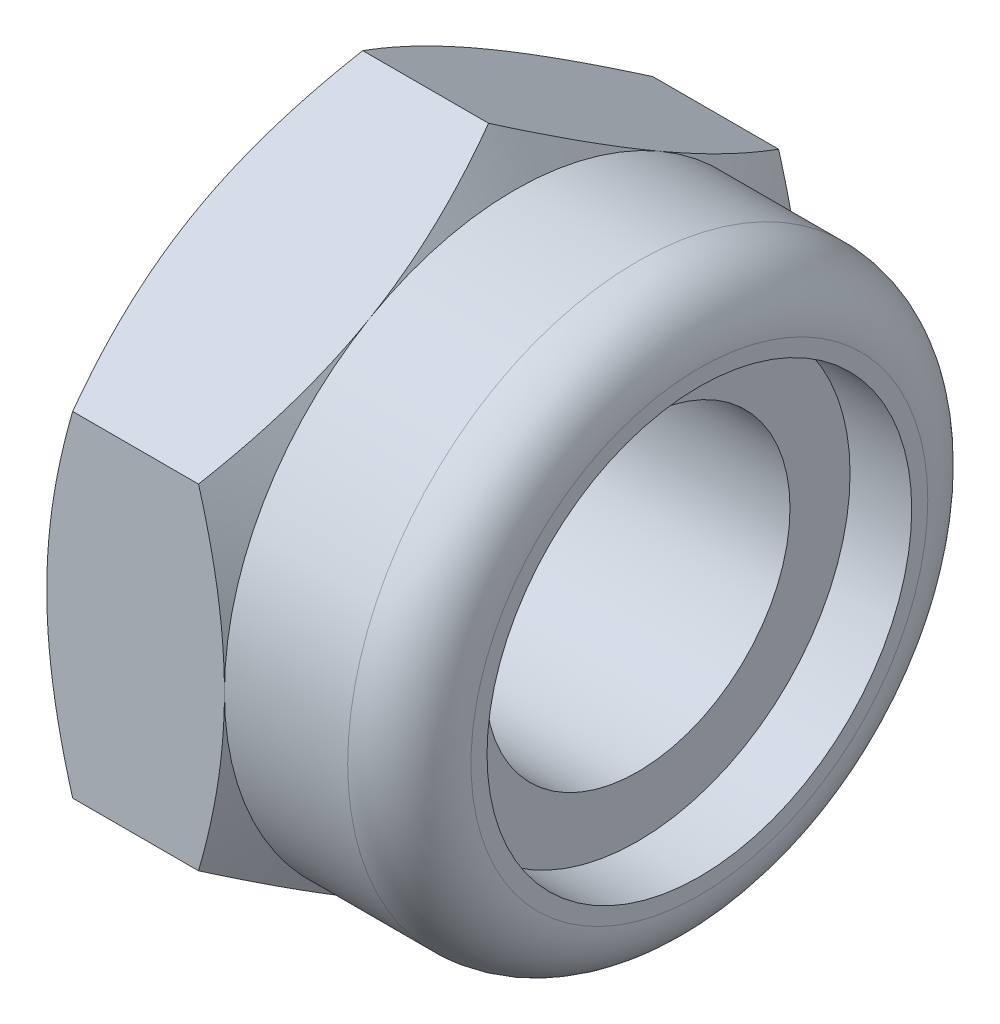
ISO-10303-21;
HEADER;
FILE_DESCRIPTION(('STEP AP214'),'2;1');
FILE_NAME('part.step','',(''),(''),'','','');
FILE_SCHEMA(('AUTOMOTIVE_DESIGN { 1 0 10303 214 1 1 1 1 }'));
ENDSEC;
DATA;
#1=APPLICATION_CONTEXT('core data for automotive mechanical design processes');
#2=APPLICATION_PROTOCOL_DEFINITION('international standard','automotive_design',2000,#1);
#3=PRODUCT_CONTEXT('',#1,'mechanical');
#4=PRODUCT('Part','Part','',(#3));
#5=PRODUCT_RELATED_PRODUCT_CATEGORY('part','',(#4));
#6=PRODUCT_DEFINITION_FORMATION('','',#4);
#7=PRODUCT_DEFINITION_CONTEXT('part definition',#1,'design');
#8=PRODUCT_DEFINITION('design','',#6,#7);
#9=PRODUCT_DEFINITION_SHAPE('','',#8);
#10=(LENGTH_UNIT() NAMED_UNIT(*) SI_UNIT(.MILLI.,.METRE.));
#11=(NAMED_UNIT(*) PLANE_ANGLE_UNIT() SI_UNIT($,.RADIAN.));
#12=(NAMED_UNIT(*) SI_UNIT($,.STERADIAN.) SOLID_ANGLE_UNIT());
#13=UNCERTAINTY_MEASURE_WITH_UNIT(LENGTH_MEASURE(1.E-05),#10,'distance_accuracy_value','');
#14=(GEOMETRIC_REPRESENTATION_CONTEXT(3) GLOBAL_UNCERTAINTY_ASSIGNED_CONTEXT((#13)) GLOBAL_UNIT_ASSIGNED_CONTEXT((#10,
#11,#12)) REPRESENTATION_CONTEXT('',''));
#15=CARTESIAN_POINT('',(0.,0.,0.));
#16=DIRECTION('',(0.,0.,1.));
#17=DIRECTION('',(1.,0.,0.));
#18=AXIS2_PLACEMENT_3D('',#15,#16,#17);
#19=CARTESIAN_POINT('',(-2.45,0.,0.));
#20=DIRECTION('',(1.,0.,0.));
#21=DIRECTION('',(0.,0.,-1.));
#22=AXIS2_PLACEMENT_3D('',#19,#20,#21);
#23=CYLINDRICAL_SURFACE('',#22,2.1);
#24=CARTESIAN_POINT('',(1.7,0.,0.));
#25=DIRECTION('',(1.,0.,0.));
#26=DIRECTION('',(0.,0.,-1.));
#27=AXIS2_PLACEMENT_3D('',#24,#25,#26);
#28=CIRCLE('',#27,2.1);
#29=CARTESIAN_POINT('',(1.7,0.,-2.1));
#30=VERTEX_POINT('',#29);
#31=EDGE_CURVE('E267',#30,#30,#28,.T.);
#32=ORIENTED_EDGE('',*,*,#31,.T.);
#33=EDGE_LOOP('',(#32));
#34=FACE_BOUND('',#33,.T.);
#35=CARTESIAN_POINT('',(-2.14451698471611,0.,0.));
#36=DIRECTION('',(-1.,0.,0.));
#37=DIRECTION('',(0.,0.,1.));
#38=AXIS2_PLACEMENT_3D('',#35,#36,#37);
#39=CIRCLE('',#38,2.1);
#40=CARTESIAN_POINT('',(-2.14451698471611,0.,2.1));
#41=VERTEX_POINT('',#40);
#42=EDGE_CURVE('E21',#41,#41,#39,.F.);
#43=ORIENTED_EDGE('',*,*,#42,.F.);
#44=EDGE_LOOP('',(#43));
#45=FACE_BOUND('',#44,.T.);
#46=ADVANCED_FACE('F16',(#34,#45),#23,.F.);
#47=CARTESIAN_POINT('',(-2.45,4.61880215351701,0.));
#48=DIRECTION('',(0.,0.866025403784438,0.500000000000001));
#49=DIRECTION('',(0.,-0.500000000000001,0.866025403784438));
#50=AXIS2_PLACEMENT_3D('',#47,#48,#49);
#51=PLANE('',#50);
#52=DIRECTION('',(1.,0.,0.));
#53=VECTOR('',#52,1.);
#54=CARTESIAN_POINT('',(-2.45,2.3094010767585,4.));
#55=LINE('',#54,#53);
#56=CARTESIAN_POINT('',(-2.09273441009184,2.30940107675851,4.));
#57=VERTEX_POINT('',#56);
#58=CARTESIAN_POINT('',(-0.357265589908164,2.3094010767585,4.));
#59=VERTEX_POINT('',#58);
#60=EDGE_CURVE('E239',#57,#59,#55,.T.);
#61=ORIENTED_EDGE('',*,*,#60,.T.);
#62=CARTESIAN_POINT('',(-0.357332259074768,2.30928560670466,4.0002));
#63=CARTESIAN_POINT('',(-0.298717873648282,2.4107717464617,3.82442084967677));
#64=CARTESIAN_POINT('',(-0.245410321462262,2.51313390883499,3.64712438367362));
#65=CARTESIAN_POINT('',(-0.152361670746403,2.71963072479811,3.28946140682429));
#66=CARTESIAN_POINT('',(-0.112653489029704,2.82376904741904,3.10908854102985));
#67=CARTESIAN_POINT('',(-0.0508422152802784,3.03075510011795,2.75057818129721));
#68=CARTESIAN_POINT('',(-0.0283277315228878,3.13357098372492,2.57249584706486));
#69=CARTESIAN_POINT('',(-0.00145062314658073,3.33968651028528,2.21549328283349));
#70=CARTESIAN_POINT('',(0.00293425857305766,3.44298540411434,2.0365743503559));
#71=CARTESIAN_POINT('',(-0.00619007293996959,3.63600352522932,1.70225715780327));
#72=CARTESIAN_POINT('',(-0.0174589539879936,3.72575165335065,1.54680884001293));
#73=CARTESIAN_POINT('',(-0.0531739907981929,3.90466320392054,1.23692494436494));
#74=CARTESIAN_POINT('',(-0.0776323457115331,3.99382600759479,1.08249043825587));
#75=CARTESIAN_POINT('',(-0.13877606491929,4.17310641015197,0.771967672225421));
#76=CARTESIAN_POINT('',(-0.175720603654864,4.26320131938131,0.615918711936897));
#77=CARTESIAN_POINT('',(-0.259570072548029,4.44204742827551,0.30614816459616));
#78=CARTESIAN_POINT('',(-0.306455302212742,4.53080091904966,0.15242260922622));
#79=CARTESIAN_POINT('',(-0.357332259074769,4.61891762357085,-0.000200000000000829));
#80=B_SPLINE_CURVE_WITH_KNOTS('',3,(#62,#63,#64,#65,#66,#67,#68,#69,#70,#71,#72,#73,#74,#75,#76,
#77,#78,#79),.UNSPECIFIED.,.F.,.F.,(4,2,2,2,2,2,2,2,4),(0.,0.634047835695967,1.26961969224544,
1.88946157213122,2.50854226669297,3.04757825393386,3.58711366126904,4.13861653143764,
4.68903648037743),.UNSPECIFIED.);
#81=CARTESIAN_POINT('',(0.,3.46410161513775,2.));
#82=VERTEX_POINT('',#81);
#83=EDGE_CURVE('E43',#59,#82,#80,.T.);
#84=ORIENTED_EDGE('',*,*,#83,.T.);
#85=CARTESIAN_POINT('',(-0.357265589908165,4.61880215351701,0.));
#86=VERTEX_POINT('',#85);
#87=EDGE_CURVE('E122',#82,#86,#80,.T.);
#88=ORIENTED_EDGE('',*,*,#87,.T.);
#89=DIRECTION('',(1.,0.,0.));
#90=VECTOR('',#89,1.);
#91=CARTESIAN_POINT('',(-2.45,4.61880215351701,0.));
#92=LINE('',#91,#90);
#93=CARTESIAN_POINT('',(-2.09273441009184,4.61880215351701,0.));
#94=VERTEX_POINT('',#93);
#95=EDGE_CURVE('E119',#94,#86,#92,.T.);
#96=ORIENTED_EDGE('',*,*,#95,.F.);
#97=CARTESIAN_POINT('',(-2.09266774092523,2.30928560670466,4.0002));
#98=CARTESIAN_POINT('',(-2.15128212635172,2.4107717464617,3.82442084967677));
#99=CARTESIAN_POINT('',(-2.20458967853774,2.51313390883499,3.64712438367362));
#100=CARTESIAN_POINT('',(-2.2976383292536,2.71963072479811,3.28946140682429));
#101=CARTESIAN_POINT('',(-2.3373465109703,2.82376904741904,3.10908854102985));
#102=CARTESIAN_POINT('',(-2.39915778471972,3.03075510011795,2.75057818129721));
#103=CARTESIAN_POINT('',(-2.42167226847711,3.13357098372492,2.57249584706486));
#104=CARTESIAN_POINT('',(-2.44854937685342,3.33968651028528,2.21549328283349));
#105=CARTESIAN_POINT('',(-2.45293425857306,3.44298540411434,2.0365743503559));
#106=CARTESIAN_POINT('',(-2.44380992706003,3.63600352522932,1.70225715780327));
#107=CARTESIAN_POINT('',(-2.43254104601201,3.72575165335065,1.54680884001293));
#108=CARTESIAN_POINT('',(-2.39682600920181,3.90466320392054,1.23692494436494));
#109=CARTESIAN_POINT('',(-2.37236765428847,3.99382600759479,1.08249043825587));
#110=CARTESIAN_POINT('',(-2.31122393508071,4.17310641015197,0.771967672225421));
#111=CARTESIAN_POINT('',(-2.27427939634514,4.26320131938131,0.615918711936897));
#112=CARTESIAN_POINT('',(-2.19042992745197,4.44204742827551,0.30614816459616));
#113=CARTESIAN_POINT('',(-2.14354469778726,4.53080091904966,0.15242260922622));
#114=CARTESIAN_POINT('',(-2.09266774092523,4.61891762357085,-0.000200000000000877));
#115=B_SPLINE_CURVE_WITH_KNOTS('',3,(#97,#98,#99,#100,#101,#102,#103,#104,#105,#106,#107,#108,
#109,#110,#111,#112,#113,#114),.UNSPECIFIED.,.F.,.F.,(4,2,2,2,2,2,2,2,4),(0.,0.634047835695968,
1.26961969224544,1.88946157213122,2.50854226669297,3.04757825393386,3.58711366126904,
4.13861653143764,4.68903648037743),.UNSPECIFIED.);
#116=CARTESIAN_POINT('',(-2.45,3.46410161513775,2.));
#117=VERTEX_POINT('',#116);
#118=EDGE_CURVE('E242',#117,#94,#115,.T.);
#119=ORIENTED_EDGE('',*,*,#118,.F.);
#120=EDGE_CURVE('E220',#57,#117,#115,.T.);
#121=ORIENTED_EDGE('',*,*,#120,.F.);
#122=EDGE_LOOP('',(#61,#84,#88,#96,#119,#121));
#123=FACE_BOUND('',#122,.T.);
#124=ADVANCED_FACE('F18',(#123),#51,.T.);
#125=CARTESIAN_POINT('',(-2.45,2.3094010767585,-4.));
#126=DIRECTION('',(0.,0.866025403784438,-0.500000000000001));
#127=DIRECTION('',(0.,0.500000000000001,0.866025403784438));
#128=AXIS2_PLACEMENT_3D('',#125,#126,#127);
#129=PLANE('',#128);
#130=ORIENTED_EDGE('',*,*,#95,.T.);
#131=CARTESIAN_POINT('',(-0.357332259074769,4.61891762357085,0.000199999999999557));
#132=CARTESIAN_POINT('',(-0.298717873648285,4.51743148381381,-0.175579150323228));
#133=CARTESIAN_POINT('',(-0.245410321462264,4.41506932144052,-0.352875616326381));
#134=CARTESIAN_POINT('',(-0.152361670746404,4.20857250547739,-0.710538593175707));
#135=CARTESIAN_POINT('',(-0.112653489029704,4.10443418285647,-0.890911458970152));
#136=CARTESIAN_POINT('',(-0.0508422152802784,3.89744813015756,-1.24942181870279));
#137=CARTESIAN_POINT('',(-0.0283277315228881,3.79463224655059,-1.42750415293514));
#138=CARTESIAN_POINT('',(-0.00145062314658083,3.58851671999023,-1.78450671716651));
#139=CARTESIAN_POINT('',(0.00293425857305792,3.48521782616117,-1.9634256496441));
#140=CARTESIAN_POINT('',(-0.00619007293996913,3.29219970504619,-2.29774284219673));
#141=CARTESIAN_POINT('',(-0.0174589539879932,3.20245157692486,-2.45319115998707));
#142=CARTESIAN_POINT('',(-0.0531739907981922,3.02354002635496,-2.76307505563506));
#143=CARTESIAN_POINT('',(-0.0776323457115321,2.93437722268072,-2.91750956174413));
#144=CARTESIAN_POINT('',(-0.138776064919289,2.75509682012354,-3.22803232777458));
#145=CARTESIAN_POINT('',(-0.175720603654863,2.6650019108942,-3.3840812880631));
#146=CARTESIAN_POINT('',(-0.259570072548027,2.486155802,-3.69385183540384));
#147=CARTESIAN_POINT('',(-0.30645530221274,2.39740231122584,-3.84757739077378));
#148=CARTESIAN_POINT('',(-0.357332259074767,2.30928560670466,-4.0002));
#149=B_SPLINE_CURVE_WITH_KNOTS('',3,(#131,#132,#133,#134,#135,#136,#137,#138,#139,#140,#141,
#142,#143,#144,#145,#146,#147,#148),.UNSPECIFIED.,.F.,.F.,(4,2,2,2,2,2,2,2,4),(0.,
0.634047835695968,1.26961969224544,1.88946157213122,2.50854226669297,3.04757825393386,
3.58711366126904,4.13861653143764,4.68903648037743),.UNSPECIFIED.);
#150=CARTESIAN_POINT('',(0.,3.46410161513775,-2.));
#151=VERTEX_POINT('',#150);
#152=EDGE_CURVE('E111',#86,#151,#149,.T.);
#153=ORIENTED_EDGE('',*,*,#152,.T.);
#154=CARTESIAN_POINT('',(-0.357265589908165,2.30940107675851,-4.));
#155=VERTEX_POINT('',#154);
#156=EDGE_CURVE('E115',#151,#155,#149,.T.);
#157=ORIENTED_EDGE('',*,*,#156,.T.);
#158=DIRECTION('',(1.,0.,0.));
#159=VECTOR('',#158,1.);
#160=CARTESIAN_POINT('',(-2.45,2.3094010767585,-4.));
#161=LINE('',#160,#159);
#162=CARTESIAN_POINT('',(-2.09273441009184,2.30940107675851,-4.));
#163=VERTEX_POINT('',#162);
#164=EDGE_CURVE('E228',#163,#155,#161,.T.);
#165=ORIENTED_EDGE('',*,*,#164,.F.);
#166=CARTESIAN_POINT('',(-2.09266774092523,4.61891762357085,0.000199999999999509));
#167=CARTESIAN_POINT('',(-2.15128212635172,4.51743148381381,-0.175579150323228));
#168=CARTESIAN_POINT('',(-2.20458967853774,4.41506932144052,-0.352875616326381));
#169=CARTESIAN_POINT('',(-2.2976383292536,4.20857250547739,-0.710538593175707));
#170=CARTESIAN_POINT('',(-2.3373465109703,4.10443418285647,-0.890911458970152));
#171=CARTESIAN_POINT('',(-2.39915778471972,3.89744813015756,-1.24942181870279));
#172=CARTESIAN_POINT('',(-2.42167226847711,3.79463224655059,-1.42750415293514));
#173=CARTESIAN_POINT('',(-2.44854937685342,3.58851671999023,-1.78450671716651));
#174=CARTESIAN_POINT('',(-2.45293425857306,3.48521782616117,-1.9634256496441));
#175=CARTESIAN_POINT('',(-2.44380992706003,3.29219970504619,-2.29774284219673));
#176=CARTESIAN_POINT('',(-2.43254104601201,3.20245157692486,-2.45319115998707));
#177=CARTESIAN_POINT('',(-2.39682600920181,3.02354002635496,-2.76307505563506));
#178=CARTESIAN_POINT('',(-2.37236765428847,2.93437722268072,-2.91750956174413));
#179=CARTESIAN_POINT('',(-2.31122393508071,2.75509682012354,-3.22803232777458));
#180=CARTESIAN_POINT('',(-2.27427939634514,2.6650019108942,-3.3840812880631));
#181=CARTESIAN_POINT('',(-2.19042992745197,2.486155802,-3.69385183540384));
#182=CARTESIAN_POINT('',(-2.14354469778726,2.39740231122584,-3.84757739077378));
#183=CARTESIAN_POINT('',(-2.09266774092523,2.30928560670466,-4.0002));
#184=B_SPLINE_CURVE_WITH_KNOTS('',3,(#166,#167,#168,#169,#170,#171,#172,#173,#174,#175,#176,
#177,#178,#179,#180,#181,#182,#183),.UNSPECIFIED.,.F.,.F.,(4,2,2,2,2,2,2,2,4),(0.,
0.634047835695967,1.26961969224544,1.88946157213122,2.50854226669297,3.04757825393386,
3.58711366126904,4.13861653143764,4.68903648037743),.UNSPECIFIED.);
#185=CARTESIAN_POINT('',(-2.45,3.46410161513775,-2.));
#186=VERTEX_POINT('',#185);
#187=EDGE_CURVE('E211',#186,#163,#184,.T.);
#188=ORIENTED_EDGE('',*,*,#187,.F.);
#189=EDGE_CURVE('E218',#94,#186,#184,.T.);
#190=ORIENTED_EDGE('',*,*,#189,.F.);
#191=EDGE_LOOP('',(#130,#153,#157,#165,#188,#190));
#192=FACE_BOUND('',#191,.T.);
#193=ADVANCED_FACE('F113',(#192),#129,.T.);
#194=CARTESIAN_POINT('',(-2.45,2.3094010767585,-4.));
#195=DIRECTION('',(0.,0.,1.));
#196=DIRECTION('',(1.,0.,0.));
#197=AXIS2_PLACEMENT_3D('',#194,#195,#196);
#198=PLANE('',#197);
#199=CARTESIAN_POINT('',(-1.91410682124064,-6.12487198995892,-4.));
#200=CARTESIAN_POINT('',(-1.8292362707669,-5.94924937038676,-4.));
#201=CARTESIAN_POINT('',(-1.7452094038074,-5.77321152095286,-4.));
#202=CARTESIAN_POINT('',(-1.57932514679716,-5.42008084777955,-4.));
#203=CARTESIAN_POINT('',(-1.49746813236723,-5.24298784779928,-4.));
#204=CARTESIAN_POINT('',(-1.33597446305856,-4.88656571686334,-4.));
#205=CARTESIAN_POINT('',(-1.25635319506304,-4.70722958889362,-4.));
#206=CARTESIAN_POINT('',(-1.1005305854203,-4.34708334747263,-4.));
#207=CARTESIAN_POINT('',(-1.02432906550802,-4.16627331143538,-4.));
#208=CARTESIAN_POINT('',(-0.875350650394363,-3.80064706744978,-4.));
#209=CARTESIAN_POINT('',(-0.802627284215846,-3.6158089282277,-4.));
#210=CARTESIAN_POINT('',(-0.66287623095942,-3.24395246794969,-4.));
#211=CARTESIAN_POINT('',(-0.595849177566504,-3.05693390695801,-4.));
#212=CARTESIAN_POINT('',(-0.469291748430882,-2.68080318253771,-4.));
#213=CARTESIAN_POINT('',(-0.409745434783837,-2.49169643712849,-4.));
#214=CARTESIAN_POINT('',(-0.300083356544506,-2.11079454635851,-4.));
#215=CARTESIAN_POINT('',(-0.249964609676752,-1.91900027185749,-4.));
#216=CARTESIAN_POINT('',(-0.161590794954042,-1.532592326982,-4.));
#217=CARTESIAN_POINT('',(-0.12333888595654,-1.3379779203165,-4.));
#218=CARTESIAN_POINT('',(-0.0612742359223428,-0.946402725872554,-4.));
#219=CARTESIAN_POINT('',(-0.0374615076516981,-0.749441936019774,-4.));
#220=CARTESIAN_POINT('',(-0.0063818131494355,-0.355451989627943,-4.));
#221=CARTESIAN_POINT('',(0.000989900761041896,-0.158431311094012,-4.));
#222=CARTESIAN_POINT('',(-0.00120406637479512,0.235472085607469,-4.));
#223=CARTESIAN_POINT('',(-0.01076535081535,0.432354826312205,-4.));
#224=CARTESIAN_POINT('',(-0.0408787346135904,0.768560635225516,-4.));
#225=CARTESIAN_POINT('',(-0.0575092960439098,0.908254618381819,-4.));
#226=CARTESIAN_POINT('',(-0.0982134103466918,1.18656349063497,-4.));
#227=CARTESIAN_POINT('',(-0.122288137058446,1.32517820601013,-4.));
#228=CARTESIAN_POINT('',(-0.20441507095023,1.73929045452969,-4.));
#229=CARTESIAN_POINT('',(-0.272348886425153,2.01284690528722,-4.));
#230=CARTESIAN_POINT('',(-0.389516359317204,2.42218253014524,-4.));
#231=CARTESIAN_POINT('',(-0.431713941811637,2.56009536361539,-4.));
#232=CARTESIAN_POINT('',(-0.520284580227763,2.83448159101404,-4.));
#233=CARTESIAN_POINT('',(-0.566654756186913,2.97095590623557,-4.));
#234=CARTESIAN_POINT('',(-0.662605699180287,3.24189440516341,-4.));
#235=CARTESIAN_POINT('',(-0.712166925753501,3.37636557946838,-4.));
#236=CARTESIAN_POINT('',(-0.814198353790703,3.64426461152914,-4.));
#237=CARTESIAN_POINT('',(-0.866669730963371,3.77769202239387,-4.));
#238=CARTESIAN_POINT('',(-0.920309006541794,3.91063698986684,-4.));
#239=B_SPLINE_CURVE_WITH_KNOTS('',3,(#199,#200,#201,#202,#203,#204,#205,#206,#207,#208,#209,
#210,#211,#212,#213,#214,#215,#216,#217,#218,#219,#220,#221,#222,#223,#224,#225,#226,#227,#228,
#229,#230,#231,#232,#233,#234,#235,#236,#237,#238),.UNSPECIFIED.,.F.,.F.,(4,2,2,2,2,2,2,2,2,2,2,
2,2,2,2,2,2,2,2,4),(0.,0.585171792532271,1.17044423059927,1.7590659464599,2.34765694284827,
2.94347400997483,3.53935727210689,4.13394864697601,4.72835161391471,5.32291267067845,
5.91747425310813,6.50823685854037,7.09884609659886,7.52068140825521,7.9425832713084,
8.7870149135983,9.21965281897689,9.65199437116297,10.0819024146297,10.5119854255247),.UNSPECIFIED.);
#240=CARTESIAN_POINT('',(-0.357265589908165,-2.30940107675851,-4.));
#241=VERTEX_POINT('',#240);
#242=CARTESIAN_POINT('',(0.,0.,-4.));
#243=VERTEX_POINT('',#242);
#244=EDGE_CURVE('E184',#241,#243,#239,.T.);
#245=ORIENTED_EDGE('',*,*,#244,.F.);
#246=DIRECTION('',(1.,0.,0.));
#247=VECTOR('',#246,1.);
#248=CARTESIAN_POINT('',(-2.45,-2.30940107675851,-4.));
#249=LINE('',#248,#247);
#250=CARTESIAN_POINT('',(-2.09273441009184,-2.30940107675851,-4.));
#251=VERTEX_POINT('',#250);
#252=EDGE_CURVE('E230',#251,#241,#249,.T.);
#253=ORIENTED_EDGE('',*,*,#252,.F.);
#254=CARTESIAN_POINT('',(-0.535893178759358,-6.12487198995892,-4.));
#255=CARTESIAN_POINT('',(-0.6207637292331,-5.94924937038676,-4.));
#256=CARTESIAN_POINT('',(-0.704790596192601,-5.77321152095286,-4.));
#257=CARTESIAN_POINT('',(-0.870674853202836,-5.42008084777954,-4.));
#258=CARTESIAN_POINT('',(-0.952531867632768,-5.24298784779927,-4.));
#259=CARTESIAN_POINT('',(-1.11402553694144,-4.88656571686334,-4.));
#260=CARTESIAN_POINT('',(-1.19364680493696,-4.70722958889362,-4.));
#261=CARTESIAN_POINT('',(-1.3494694145797,-4.34708334747263,-4.));
#262=CARTESIAN_POINT('',(-1.42567093449198,-4.16627331143537,-4.));
#263=CARTESIAN_POINT('',(-1.57464934960564,-3.80064706744977,-4.));
#264=CARTESIAN_POINT('',(-1.64737271578416,-3.6158089282277,-4.));
#265=CARTESIAN_POINT('',(-1.78712376904058,-3.24395246794968,-4.));
#266=CARTESIAN_POINT('',(-1.8541508224335,-3.05693390695801,-4.));
#267=CARTESIAN_POINT('',(-1.98070825156912,-2.6808031825377,-4.));
#268=CARTESIAN_POINT('',(-2.04025456521616,-2.49169643712848,-4.));
#269=CARTESIAN_POINT('',(-2.14991664345549,-2.11079454635851,-4.));
#270=CARTESIAN_POINT('',(-2.20003539032325,-1.91900027185749,-4.));
#271=CARTESIAN_POINT('',(-2.28840920504596,-1.532592326982,-4.));
#272=CARTESIAN_POINT('',(-2.32666111404346,-1.3379779203165,-4.));
#273=CARTESIAN_POINT('',(-2.38872576407766,-0.946402725872555,-4.));
#274=CARTESIAN_POINT('',(-2.4125384923483,-0.749441936019774,-4.));
#275=CARTESIAN_POINT('',(-2.44361818685056,-0.355451989627943,-4.));
#276=CARTESIAN_POINT('',(-2.45098990076104,-0.158431311094012,-4.));
#277=CARTESIAN_POINT('',(-2.44879593362521,0.235472085607468,-4.));
#278=CARTESIAN_POINT('',(-2.43923464918465,0.432354826312205,-4.));
#279=CARTESIAN_POINT('',(-2.40912126538641,0.768560635225517,-4.));
#280=CARTESIAN_POINT('',(-2.39249070395609,0.908254618381819,-4.));
#281=CARTESIAN_POINT('',(-2.35178658965331,1.18656349063497,-4.));
#282=CARTESIAN_POINT('',(-2.32771186294155,1.32517820601013,-4.));
#283=CARTESIAN_POINT('',(-2.24558492904977,1.73929045452969,-4.));
#284=CARTESIAN_POINT('',(-2.17765111357485,2.01284690528722,-4.));
#285=CARTESIAN_POINT('',(-2.0604836406828,2.42218253014524,-4.));
#286=CARTESIAN_POINT('',(-2.01828605818836,2.56009536361539,-4.));
#287=CARTESIAN_POINT('',(-1.92971541977224,2.83448159101404,-4.));
#288=CARTESIAN_POINT('',(-1.88334524381309,2.97095590623558,-4.));
#289=CARTESIAN_POINT('',(-1.78739430081971,3.24189440516341,-4.));
#290=CARTESIAN_POINT('',(-1.7378330742465,3.37636557946838,-4.));
#291=CARTESIAN_POINT('',(-1.6358016462093,3.64426461152914,-4.));
#292=CARTESIAN_POINT('',(-1.58333026903663,3.77769202239387,-4.));
#293=CARTESIAN_POINT('',(-1.52969099345821,3.91063698986684,-4.));
#294=B_SPLINE_CURVE_WITH_KNOTS('',3,(#254,#255,#256,#257,#258,#259,#260,#261,#262,#263,#264,
#265,#266,#267,#268,#269,#270,#271,#272,#273,#274,#275,#276,#277,#278,#279,#280,#281,#282,#283,
#284,#285,#286,#287,#288,#289,#290,#291,#292,#293),.UNSPECIFIED.,.F.,.F.,(4,2,2,2,2,2,2,2,2,2,2,
2,2,2,2,2,2,2,2,4),(0.,0.585171792532273,1.17044423059927,1.7590659464599,2.34765694284827,
2.94347400997484,3.53935727210689,4.13394864697601,4.72835161391471,5.32291267067845,
5.91747425310813,6.50823685854037,7.09884609659886,7.52068140825522,7.9425832713084,
8.7870149135983,9.2196528189769,9.65199437116298,10.0819024146297,10.5119854255247),.UNSPECIFIED.);
#295=CARTESIAN_POINT('',(-2.45,0.,-4.));
#296=VERTEX_POINT('',#295);
#297=EDGE_CURVE('E377',#251,#296,#294,.T.);
#298=ORIENTED_EDGE('',*,*,#297,.T.);
#299=EDGE_CURVE('E219',#296,#163,#294,.T.);
#300=ORIENTED_EDGE('',*,*,#299,.T.);
#301=ORIENTED_EDGE('',*,*,#164,.T.);
#302=EDGE_CURVE('E129',#243,#155,#239,.T.);
#303=ORIENTED_EDGE('',*,*,#302,.F.);
#304=EDGE_LOOP('',(#245,#253,#298,#300,#301,#303));
#305=FACE_BOUND('',#304,.T.);
#306=ADVANCED_FACE('F206',(#305),#198,.F.);
#307=CARTESIAN_POINT('',(-2.45,-4.61880215351701,0.));
#308=DIRECTION('',(0.,-0.866025403784438,-0.500000000000001));
#309=DIRECTION('',(0.,0.500000000000001,-0.866025403784438));
#310=AXIS2_PLACEMENT_3D('',#307,#308,#309);
#311=PLANE('',#310);
#312=ORIENTED_EDGE('',*,*,#252,.T.);
#313=CARTESIAN_POINT('',(-0.357332259074769,-2.30928560670467,-4.0002));
#314=CARTESIAN_POINT('',(-0.298717873648284,-2.41077174646171,-3.82442084967677));
#315=CARTESIAN_POINT('',(-0.245410321462264,-2.513133908835,-3.64712438367362));
#316=CARTESIAN_POINT('',(-0.152361670746405,-2.71963072479812,-3.28946140682429));
#317=CARTESIAN_POINT('',(-0.112653489029705,-2.82376904741905,-3.10908854102985));
#318=CARTESIAN_POINT('',(-0.0508422152802804,-3.03075510011796,-2.75057818129721));
#319=CARTESIAN_POINT('',(-0.0283277315228903,-3.13357098372492,-2.57249584706486));
#320=CARTESIAN_POINT('',(-0.00145062314658341,-3.33968651028529,-2.21549328283349));
#321=CARTESIAN_POINT('',(0.00293425857305511,-3.44298540411435,-2.0365743503559));
#322=CARTESIAN_POINT('',(-0.00619007293997252,-3.63600352522933,-1.70225715780326));
#323=CARTESIAN_POINT('',(-0.0174589539879969,-3.72575165335065,-1.54680884001293));
#324=CARTESIAN_POINT('',(-0.0531739907981964,-3.90466320392055,-1.23692494436494));
#325=CARTESIAN_POINT('',(-0.0776323457115366,-3.99382600759479,-1.08249043825587));
#326=CARTESIAN_POINT('',(-0.138776064919293,-4.17310641015198,-0.771967672225421));
#327=CARTESIAN_POINT('',(-0.175720603654868,-4.26320131938132,-0.615918711936897));
#328=CARTESIAN_POINT('',(-0.259570072548032,-4.44204742827551,-0.30614816459616));
#329=CARTESIAN_POINT('',(-0.306455302212745,-4.53080091904967,-0.152422609226221));
#330=CARTESIAN_POINT('',(-0.357332259074773,-4.61891762357085,0.000200000000000193));
#331=B_SPLINE_CURVE_WITH_KNOTS('',3,(#313,#314,#315,#316,#317,#318,#319,#320,#321,#322,#323,
#324,#325,#326,#327,#328,#329,#330),.UNSPECIFIED.,.F.,.F.,(4,2,2,2,2,2,2,2,4),(0.,
0.634047835695967,1.26961969224544,1.88946157213122,2.50854226669298,3.04757825393386,
3.58711366126904,4.13861653143764,4.68903648037743),.UNSPECIFIED.);
#332=CARTESIAN_POINT('',(0.,-3.46410161513775,-2.));
#333=VERTEX_POINT('',#332);
#334=EDGE_CURVE('E315',#241,#333,#331,.T.);
#335=ORIENTED_EDGE('',*,*,#334,.T.);
#336=CARTESIAN_POINT('',(-0.357265589908165,-4.61880215351701,0.));
#337=VERTEX_POINT('',#336);
#338=EDGE_CURVE('E177',#333,#337,#331,.T.);
#339=ORIENTED_EDGE('',*,*,#338,.T.);
#340=DIRECTION('',(1.,0.,0.));
#341=VECTOR('',#340,1.);
#342=CARTESIAN_POINT('',(-2.45,-4.61880215351701,0.));
#343=LINE('',#342,#341);
#344=CARTESIAN_POINT('',(-2.09273441009184,-4.61880215351701,0.));
#345=VERTEX_POINT('',#344);
#346=EDGE_CURVE('E233',#345,#337,#343,.T.);
#347=ORIENTED_EDGE('',*,*,#346,.F.);
#348=CARTESIAN_POINT('',(-2.09266774092523,-2.30928560670467,-4.0002));
#349=CARTESIAN_POINT('',(-2.15128212635172,-2.41077174646171,-3.82442084967677));
#350=CARTESIAN_POINT('',(-2.20458967853774,-2.513133908835,-3.64712438367362));
#351=CARTESIAN_POINT('',(-2.2976383292536,-2.71963072479812,-3.28946140682429));
#352=CARTESIAN_POINT('',(-2.3373465109703,-2.82376904741905,-3.10908854102985));
#353=CARTESIAN_POINT('',(-2.39915778471972,-3.03075510011796,-2.75057818129721));
#354=CARTESIAN_POINT('',(-2.42167226847711,-3.13357098372492,-2.57249584706486));
#355=CARTESIAN_POINT('',(-2.44854937685342,-3.33968651028529,-2.21549328283349));
#356=CARTESIAN_POINT('',(-2.45293425857306,-3.44298540411435,-2.0365743503559));
#357=CARTESIAN_POINT('',(-2.44380992706003,-3.63600352522933,-1.70225715780326));
#358=CARTESIAN_POINT('',(-2.432541046012,-3.72575165335065,-1.54680884001293));
#359=CARTESIAN_POINT('',(-2.3968260092018,-3.90466320392055,-1.23692494436494));
#360=CARTESIAN_POINT('',(-2.37236765428846,-3.99382600759479,-1.08249043825587));
#361=CARTESIAN_POINT('',(-2.31122393508071,-4.17310641015198,-0.771967672225421));
#362=CARTESIAN_POINT('',(-2.27427939634513,-4.26320131938132,-0.615918711936897));
#363=CARTESIAN_POINT('',(-2.19042992745197,-4.44204742827551,-0.30614816459616));
#364=CARTESIAN_POINT('',(-2.14354469778725,-4.53080091904967,-0.15242260922622));
#365=CARTESIAN_POINT('',(-2.09266774092523,-4.61891762357085,0.000200000000000137));
#366=B_SPLINE_CURVE_WITH_KNOTS('',3,(#348,#349,#350,#351,#352,#353,#354,#355,#356,#357,#358,
#359,#360,#361,#362,#363,#364,#365),.UNSPECIFIED.,.F.,.F.,(4,2,2,2,2,2,2,2,4),(0.,
0.634047835695967,1.26961969224544,1.88946157213122,2.50854226669298,3.04757825393386,
3.58711366126904,4.13861653143764,4.68903648037743),.UNSPECIFIED.);
#367=CARTESIAN_POINT('',(-2.45,-3.46410161513775,-2.));
#368=VERTEX_POINT('',#367);
#369=EDGE_CURVE('E351',#368,#345,#366,.T.);
#370=ORIENTED_EDGE('',*,*,#369,.F.);
#371=EDGE_CURVE('E376',#251,#368,#366,.T.);
#372=ORIENTED_EDGE('',*,*,#371,.F.);
#373=EDGE_LOOP('',(#312,#335,#339,#347,#370,#372));
#374=FACE_BOUND('',#373,.T.);
#375=ADVANCED_FACE('F367',(#374),#311,.T.);
#376=CARTESIAN_POINT('',(-2.45,-2.30940107675851,4.));
#377=DIRECTION('',(0.,-0.866025403784438,0.500000000000001));
#378=DIRECTION('',(0.,-0.500000000000001,-0.866025403784438));
#379=AXIS2_PLACEMENT_3D('',#376,#377,#378);
#380=PLANE('',#379);
#381=ORIENTED_EDGE('',*,*,#346,.T.);
#382=CARTESIAN_POINT('',(-0.357332259074773,-4.61891762357085,-0.00019999999999976));
#383=CARTESIAN_POINT('',(-0.298717873648288,-4.51743148381381,0.175579150323228));
#384=CARTESIAN_POINT('',(-0.245410321462267,-4.41506932144052,0.352875616326381));
#385=CARTESIAN_POINT('',(-0.152361670746407,-4.2085725054774,0.710538593175708));
#386=CARTESIAN_POINT('',(-0.112653489029707,-4.10443418285647,0.890911458970153));
#387=CARTESIAN_POINT('',(-0.0508422152802817,-3.89744813015756,1.24942181870279));
#388=CARTESIAN_POINT('',(-0.0283277315228913,-3.7946322465506,1.42750415293515));
#389=CARTESIAN_POINT('',(-0.00145062314658384,-3.58851671999023,1.78450671716651));
#390=CARTESIAN_POINT('',(0.00293425857305513,-3.48521782616117,1.9634256496441));
#391=CARTESIAN_POINT('',(-0.00619007293997194,-3.29219970504619,2.29774284219674));
#392=CARTESIAN_POINT('',(-0.0174589539879962,-3.20245157692487,2.45319115998707));
#393=CARTESIAN_POINT('',(-0.0531739907981951,-3.02354002635497,2.76307505563506));
#394=CARTESIAN_POINT('',(-0.0776323457115348,-2.93437722268073,2.91750956174413));
#395=CARTESIAN_POINT('',(-0.138776064919291,-2.75509682012354,3.22803232777458));
#396=CARTESIAN_POINT('',(-0.175720603654865,-2.6650019108942,3.3840812880631));
#397=CARTESIAN_POINT('',(-0.259570072548029,-2.48615580200001,3.69385183540384));
#398=CARTESIAN_POINT('',(-0.306455302212742,-2.39740231122585,3.84757739077378));
#399=CARTESIAN_POINT('',(-0.357332259074769,-2.30928560670467,4.0002));
#400=B_SPLINE_CURVE_WITH_KNOTS('',3,(#382,#383,#384,#385,#386,#387,#388,#389,#390,#391,#392,
#393,#394,#395,#396,#397,#398,#399),.UNSPECIFIED.,.F.,.F.,(4,2,2,2,2,2,2,2,4),(0.,
0.634047835695968,1.26961969224544,1.88946157213123,2.50854226669298,3.04757825393386,
3.58711366126904,4.13861653143764,4.68903648037743),.UNSPECIFIED.);
#401=CARTESIAN_POINT('',(0.,-3.46410161513775,2.));
#402=VERTEX_POINT('',#401);
#403=EDGE_CURVE('E308',#337,#402,#400,.T.);
#404=ORIENTED_EDGE('',*,*,#403,.T.);
#405=CARTESIAN_POINT('',(-0.357265589908165,-2.30940107675851,4.));
#406=VERTEX_POINT('',#405);
#407=EDGE_CURVE('E150',#402,#406,#400,.T.);
#408=ORIENTED_EDGE('',*,*,#407,.T.);
#409=DIRECTION('',(1.,0.,0.));
#410=VECTOR('',#409,1.);
#411=CARTESIAN_POINT('',(-2.45,-2.30940107675851,4.));
#412=LINE('',#411,#410);
#413=CARTESIAN_POINT('',(-2.09273441009184,-2.30940107675851,4.));
#414=VERTEX_POINT('',#413);
#415=EDGE_CURVE('E236',#414,#406,#412,.T.);
#416=ORIENTED_EDGE('',*,*,#415,.F.);
#417=CARTESIAN_POINT('',(-2.09266774092523,-4.61891762357085,-0.000199999999999808));
#418=CARTESIAN_POINT('',(-2.15128212635171,-4.51743148381381,0.175579150323228));
#419=CARTESIAN_POINT('',(-2.20458967853773,-4.41506932144052,0.352875616326382));
#420=CARTESIAN_POINT('',(-2.29763832925359,-4.2085725054774,0.710538593175708));
#421=CARTESIAN_POINT('',(-2.33734651097029,-4.10443418285647,0.890911458970153));
#422=CARTESIAN_POINT('',(-2.39915778471972,-3.89744813015756,1.24942181870279));
#423=CARTESIAN_POINT('',(-2.42167226847711,-3.7946322465506,1.42750415293515));
#424=CARTESIAN_POINT('',(-2.44854937685342,-3.58851671999023,1.78450671716651));
#425=CARTESIAN_POINT('',(-2.45293425857306,-3.48521782616117,1.9634256496441));
#426=CARTESIAN_POINT('',(-2.44380992706003,-3.29219970504619,2.29774284219674));
#427=CARTESIAN_POINT('',(-2.432541046012,-3.20245157692487,2.45319115998707));
#428=CARTESIAN_POINT('',(-2.39682600920181,-3.02354002635497,2.76307505563506));
#429=CARTESIAN_POINT('',(-2.37236765428847,-2.93437722268073,2.91750956174413));
#430=CARTESIAN_POINT('',(-2.31122393508071,-2.75509682012354,3.22803232777458));
#431=CARTESIAN_POINT('',(-2.27427939634513,-2.6650019108942,3.3840812880631));
#432=CARTESIAN_POINT('',(-2.19042992745197,-2.48615580200001,3.69385183540384));
#433=CARTESIAN_POINT('',(-2.14354469778726,-2.39740231122585,3.84757739077378));
#434=CARTESIAN_POINT('',(-2.09266774092523,-2.30928560670467,4.0002));
#435=B_SPLINE_CURVE_WITH_KNOTS('',3,(#417,#418,#419,#420,#421,#422,#423,#424,#425,#426,#427,
#428,#429,#430,#431,#432,#433,#434),.UNSPECIFIED.,.F.,.F.,(4,2,2,2,2,2,2,2,4),(0.,
0.634047835695968,1.26961969224544,1.88946157213123,2.50854226669298,3.04757825393386,
3.58711366126904,4.13861653143764,4.68903648037744),.UNSPECIFIED.);
#436=CARTESIAN_POINT('',(-2.45,-3.46410161513775,2.));
#437=VERTEX_POINT('',#436);
#438=EDGE_CURVE('E345',#437,#414,#435,.T.);
#439=ORIENTED_EDGE('',*,*,#438,.F.);
#440=EDGE_CURVE('E346',#345,#437,#435,.T.);
#441=ORIENTED_EDGE('',*,*,#440,.F.);
#442=EDGE_LOOP('',(#381,#404,#408,#416,#439,#441));
#443=FACE_BOUND('',#442,.T.);
#444=ADVANCED_FACE('F311',(#443),#380,.T.);
#445=CARTESIAN_POINT('',(-2.45,2.3094010767585,4.));
#446=DIRECTION('',(0.,0.,1.));
#447=DIRECTION('',(1.,0.,0.));
#448=AXIS2_PLACEMENT_3D('',#445,#446,#447);
#449=PLANE('',#448);
#450=ORIENTED_EDGE('',*,*,#415,.T.);
#451=CARTESIAN_POINT('',(-1.91410682124064,-6.12487198995892,4.));
#452=CARTESIAN_POINT('',(-1.8292362707669,-5.94924937038676,4.));
#453=CARTESIAN_POINT('',(-1.7452094038074,-5.77321152095286,4.));
#454=CARTESIAN_POINT('',(-1.57932514679716,-5.42008084777954,4.));
#455=CARTESIAN_POINT('',(-1.49746813236723,-5.24298784779928,4.));
#456=CARTESIAN_POINT('',(-1.33597446305856,-4.88656571686334,4.));
#457=CARTESIAN_POINT('',(-1.25635319506304,-4.70722958889362,4.));
#458=CARTESIAN_POINT('',(-1.1005305854203,-4.34708334747263,4.));
#459=CARTESIAN_POINT('',(-1.02432906550802,-4.16627331143537,4.));
#460=CARTESIAN_POINT('',(-0.875350650394363,-3.80064706744978,4.));
#461=CARTESIAN_POINT('',(-0.802627284215846,-3.6158089282277,4.));
#462=CARTESIAN_POINT('',(-0.66287623095942,-3.24395246794968,4.));
#463=CARTESIAN_POINT('',(-0.595849177566504,-3.05693390695801,4.));
#464=CARTESIAN_POINT('',(-0.469291748430881,-2.68080318253771,4.));
#465=CARTESIAN_POINT('',(-0.409745434783837,-2.49169643712849,4.));
#466=CARTESIAN_POINT('',(-0.300083356544506,-2.11079454635851,4.));
#467=CARTESIAN_POINT('',(-0.249964609676752,-1.91900027185749,4.));
#468=CARTESIAN_POINT('',(-0.161590794954041,-1.532592326982,4.));
#469=CARTESIAN_POINT('',(-0.123338885956539,-1.3379779203165,4.));
#470=CARTESIAN_POINT('',(-0.0612742359223427,-0.946402725872553,4.));
#471=CARTESIAN_POINT('',(-0.0374615076516984,-0.749441936019772,4.));
#472=CARTESIAN_POINT('',(-0.0063818131494359,-0.355451989627941,4.));
#473=CARTESIAN_POINT('',(0.000989900761041723,-0.15843131109401,4.));
#474=CARTESIAN_POINT('',(-0.00120406637479555,0.23547208560747,4.));
#475=CARTESIAN_POINT('',(-0.010765350815351,0.432354826312206,4.));
#476=CARTESIAN_POINT('',(-0.040878734613591,0.768560635225518,4.));
#477=CARTESIAN_POINT('',(-0.05750929604391,0.908254618381821,4.));
#478=CARTESIAN_POINT('',(-0.0982134103466921,1.18656349063497,4.));
#479=CARTESIAN_POINT('',(-0.122288137058447,1.32517820601013,4.));
#480=CARTESIAN_POINT('',(-0.204415070950232,1.73929045452969,4.));
#481=CARTESIAN_POINT('',(-0.272348886425154,2.01284690528722,4.));
#482=CARTESIAN_POINT('',(-0.389516359317204,2.42218253014524,4.));
#483=CARTESIAN_POINT('',(-0.431713941811637,2.56009536361539,4.));
#484=CARTESIAN_POINT('',(-0.520284580227764,2.83448159101404,4.));
#485=CARTESIAN_POINT('',(-0.566654756186914,2.97095590623558,4.));
#486=CARTESIAN_POINT('',(-0.662605699180289,3.24189440516341,4.));
#487=CARTESIAN_POINT('',(-0.712166925753502,3.37636557946838,4.));
#488=CARTESIAN_POINT('',(-0.814198353790704,3.64426461152914,4.));
#489=CARTESIAN_POINT('',(-0.866669730963372,3.77769202239387,4.));
#490=CARTESIAN_POINT('',(-0.920309006541795,3.91063698986685,4.));
#491=B_SPLINE_CURVE_WITH_KNOTS('',3,(#451,#452,#453,#454,#455,#456,#457,#458,#459,#460,#461,
#462,#463,#464,#465,#466,#467,#468,#469,#470,#471,#472,#473,#474,#475,#476,#477,#478,#479,#480,
#481,#482,#483,#484,#485,#486,#487,#488,#489,#490),.UNSPECIFIED.,.F.,.F.,(4,2,2,2,2,2,2,2,2,2,2,
2,2,2,2,2,2,2,2,4),(0.,0.585171792532271,1.17044423059927,1.7590659464599,2.34765694284827,
2.94347400997483,3.53935727210689,4.13394864697601,4.72835161391471,5.32291267067845,
5.91747425310813,6.50823685854037,7.09884609659886,7.52068140825522,7.9425832713084,
8.7870149135983,9.2196528189769,9.65199437116298,10.0819024146297,10.5119854255247),.UNSPECIFIED.);
#492=CARTESIAN_POINT('',(0.,0.,4.));
#493=VERTEX_POINT('',#492);
#494=EDGE_CURVE('E137',#406,#493,#491,.T.);
#495=ORIENTED_EDGE('',*,*,#494,.T.);
#496=EDGE_CURVE('E135',#493,#59,#491,.T.);
#497=ORIENTED_EDGE('',*,*,#496,.T.);
#498=ORIENTED_EDGE('',*,*,#60,.F.);
#499=CARTESIAN_POINT('',(-0.535893178759359,-6.12487198995892,4.));
#500=CARTESIAN_POINT('',(-0.620763729233101,-5.94924937038676,4.));
#501=CARTESIAN_POINT('',(-0.704790596192602,-5.77321152095286,4.));
#502=CARTESIAN_POINT('',(-0.870674853202836,-5.42008084777954,4.));
#503=CARTESIAN_POINT('',(-0.952531867632769,-5.24298784779927,4.));
#504=CARTESIAN_POINT('',(-1.11402553694144,-4.88656571686334,4.));
#505=CARTESIAN_POINT('',(-1.19364680493696,-4.70722958889362,4.));
#506=CARTESIAN_POINT('',(-1.3494694145797,-4.34708334747263,4.));
#507=CARTESIAN_POINT('',(-1.42567093449198,-4.16627331143537,4.));
#508=CARTESIAN_POINT('',(-1.57464934960564,-3.80064706744977,4.));
#509=CARTESIAN_POINT('',(-1.64737271578416,-3.6158089282277,4.));
#510=CARTESIAN_POINT('',(-1.78712376904058,-3.24395246794968,4.));
#511=CARTESIAN_POINT('',(-1.8541508224335,-3.05693390695801,4.));
#512=CARTESIAN_POINT('',(-1.98070825156912,-2.6808031825377,4.));
#513=CARTESIAN_POINT('',(-2.04025456521616,-2.49169643712848,4.));
#514=CARTESIAN_POINT('',(-2.14991664345549,-2.11079454635851,4.));
#515=CARTESIAN_POINT('',(-2.20003539032325,-1.91900027185749,4.));
#516=CARTESIAN_POINT('',(-2.28840920504596,-1.532592326982,4.));
#517=CARTESIAN_POINT('',(-2.32666111404346,-1.3379779203165,4.));
#518=CARTESIAN_POINT('',(-2.38872576407766,-0.946402725872553,4.));
#519=CARTESIAN_POINT('',(-2.4125384923483,-0.749441936019773,4.));
#520=CARTESIAN_POINT('',(-2.44361818685056,-0.355451989627942,4.));
#521=CARTESIAN_POINT('',(-2.45098990076104,-0.158431311094011,4.));
#522=CARTESIAN_POINT('',(-2.44879593362521,0.235472085607469,4.));
#523=CARTESIAN_POINT('',(-2.43923464918465,0.432354826312206,4.));
#524=CARTESIAN_POINT('',(-2.40912126538641,0.768560635225518,4.));
#525=CARTESIAN_POINT('',(-2.39249070395609,0.90825461838182,4.));
#526=CARTESIAN_POINT('',(-2.35178658965331,1.18656349063497,4.));
#527=CARTESIAN_POINT('',(-2.32771186294155,1.32517820601013,4.));
#528=CARTESIAN_POINT('',(-2.24558492904977,1.73929045452969,4.));
#529=CARTESIAN_POINT('',(-2.17765111357485,2.01284690528722,4.));
#530=CARTESIAN_POINT('',(-2.0604836406828,2.42218253014524,4.));
#531=CARTESIAN_POINT('',(-2.01828605818836,2.56009536361539,4.));
#532=CARTESIAN_POINT('',(-1.92971541977224,2.83448159101404,4.));
#533=CARTESIAN_POINT('',(-1.88334524381309,2.97095590623558,4.));
#534=CARTESIAN_POINT('',(-1.78739430081971,3.24189440516341,4.));
#535=CARTESIAN_POINT('',(-1.7378330742465,3.37636557946838,4.));
#536=CARTESIAN_POINT('',(-1.6358016462093,3.64426461152914,4.));
#537=CARTESIAN_POINT('',(-1.58333026903663,3.77769202239387,4.));
#538=CARTESIAN_POINT('',(-1.52969099345821,3.91063698986684,4.));
#539=B_SPLINE_CURVE_WITH_KNOTS('',3,(#499,#500,#501,#502,#503,#504,#505,#506,#507,#508,#509,
#510,#511,#512,#513,#514,#515,#516,#517,#518,#519,#520,#521,#522,#523,#524,#525,#526,#527,#528,
#529,#530,#531,#532,#533,#534,#535,#536,#537,#538),.UNSPECIFIED.,.F.,.F.,(4,2,2,2,2,2,2,2,2,2,2,
2,2,2,2,2,2,2,2,4),(0.,0.585171792532272,1.17044423059927,1.7590659464599,2.34765694284827,
2.94347400997484,3.53935727210689,4.13394864697601,4.72835161391471,5.32291267067845,
5.91747425310813,6.50823685854037,7.09884609659886,7.52068140825522,7.9425832713084,
8.7870149135983,9.2196528189769,9.65199437116298,10.0819024146297,10.5119854255247),.UNSPECIFIED.);
#540=CARTESIAN_POINT('',(-2.45,0.,4.));
#541=VERTEX_POINT('',#540);
#542=EDGE_CURVE('E299',#541,#57,#539,.T.);
#543=ORIENTED_EDGE('',*,*,#542,.F.);
#544=EDGE_CURVE('E349',#414,#541,#539,.T.);
#545=ORIENTED_EDGE('',*,*,#544,.F.);
#546=EDGE_LOOP('',(#450,#495,#497,#498,#543,#545));
#547=FACE_BOUND('',#546,.T.);
#548=ADVANCED_FACE('F157',(#547),#449,.T.);
#549=CARTESIAN_POINT('',(-2.45,0.,7.99999999999999));
#550=DIRECTION('',(1.,0.,0.));
#551=DIRECTION('',(0.,0.,-1.));
#552=AXIS2_PLACEMENT_3D('',#549,#550,#551);
#553=PLANE('',#552);
#554=CARTESIAN_POINT('',(-2.45,0.,0.));
#555=DIRECTION('',(1.,0.,0.));
#556=DIRECTION('',(0.,0.,-1.));
#557=AXIS2_PLACEMENT_3D('',#554,#555,#556);
#558=CIRCLE('',#557,2.5);
#559=CARTESIAN_POINT('',(-2.45,0.,-2.5));
#560=VERTEX_POINT('',#559);
#561=EDGE_CURVE('E140',#560,#560,#558,.F.);
#562=ORIENTED_EDGE('',*,*,#561,.F.);
#563=EDGE_LOOP('',(#562));
#564=FACE_BOUND('',#563,.T.);
#565=CARTESIAN_POINT('',(-2.45,0.,0.));
#566=DIRECTION('',(1.,0.,0.));
#567=DIRECTION('',(0.,0.,-1.));
#568=AXIS2_PLACEMENT_3D('',#565,#566,#567);
#569=CIRCLE('',#568,4.);
#570=EDGE_CURVE('E201',#296,#186,#569,.T.);
#571=ORIENTED_EDGE('',*,*,#570,.F.);
#572=CARTESIAN_POINT('',(-2.45,0.,0.));
#573=DIRECTION('',(1.,0.,0.));
#574=DIRECTION('',(0.,0.,-1.));
#575=AXIS2_PLACEMENT_3D('',#572,#573,#574);
#576=CIRCLE('',#575,4.);
#577=EDGE_CURVE('E243',#296,#368,#576,.F.);
#578=ORIENTED_EDGE('',*,*,#577,.T.);
#579=EDGE_CURVE('E245',#368,#437,#576,.F.);
#580=ORIENTED_EDGE('',*,*,#579,.T.);
#581=EDGE_CURVE('E338',#437,#541,#576,.F.);
#582=ORIENTED_EDGE('',*,*,#581,.T.);
#583=EDGE_CURVE('E336',#541,#117,#576,.F.);
#584=ORIENTED_EDGE('',*,*,#583,.T.);
#585=EDGE_CURVE('E227',#117,#186,#576,.F.);
#586=ORIENTED_EDGE('',*,*,#585,.T.);
#587=EDGE_LOOP('',(#571,#578,#580,#582,#584,#586));
#588=FACE_BOUND('',#587,.T.);
#589=ADVANCED_FACE('F207',(#564,#588),#553,.F.);
#590=CARTESIAN_POINT('',(-2.45,0.,0.));
#591=DIRECTION('',(1.,0.,0.));
#592=DIRECTION('',(0.,0.,-1.));
#593=AXIS2_PLACEMENT_3D('',#590,#591,#592);
#594=CONICAL_SURFACE('',#593,4.,1.0471975511966);
#595=ORIENTED_EDGE('',*,*,#187,.T.);
#596=ORIENTED_EDGE('',*,*,#299,.F.);
#597=ORIENTED_EDGE('',*,*,#570,.T.);
#598=EDGE_LOOP('',(#595,#596,#597));
#599=FACE_BOUND('',#598,.T.);
#600=ADVANCED_FACE('F329',(#599),#594,.T.);
#601=ORIENTED_EDGE('',*,*,#118,.T.);
#602=ORIENTED_EDGE('',*,*,#189,.T.);
#603=ORIENTED_EDGE('',*,*,#585,.F.);
#604=EDGE_LOOP('',(#601,#602,#603));
#605=FACE_BOUND('',#604,.T.);
#606=ADVANCED_FACE('F386',(#605),#594,.T.);
#607=ORIENTED_EDGE('',*,*,#120,.T.);
#608=ORIENTED_EDGE('',*,*,#583,.F.);
#609=ORIENTED_EDGE('',*,*,#542,.T.);
#610=EDGE_LOOP('',(#607,#608,#609));
#611=FACE_BOUND('',#610,.T.);
#612=ADVANCED_FACE('F385',(#611),#594,.T.);
#613=ORIENTED_EDGE('',*,*,#438,.T.);
#614=ORIENTED_EDGE('',*,*,#544,.T.);
#615=ORIENTED_EDGE('',*,*,#581,.F.);
#616=EDGE_LOOP('',(#613,#614,#615));
#617=FACE_BOUND('',#616,.T.);
#618=ADVANCED_FACE('F169',(#617),#594,.T.);
#619=ORIENTED_EDGE('',*,*,#369,.T.);
#620=ORIENTED_EDGE('',*,*,#440,.T.);
#621=ORIENTED_EDGE('',*,*,#579,.F.);
#622=EDGE_LOOP('',(#619,#620,#621));
#623=FACE_BOUND('',#622,.T.);
#624=ADVANCED_FACE('F383',(#623),#594,.T.);
#625=ORIENTED_EDGE('',*,*,#371,.T.);
#626=ORIENTED_EDGE('',*,*,#577,.F.);
#627=ORIENTED_EDGE('',*,*,#297,.F.);
#628=EDGE_LOOP('',(#625,#626,#627));
#629=FACE_BOUND('',#628,.T.);
#630=ADVANCED_FACE('F391',(#629),#594,.T.);
#631=CARTESIAN_POINT('',(0.,0.,0.));
#632=DIRECTION('',(-1.,0.,0.));
#633=DIRECTION('',(0.,0.,1.));
#634=AXIS2_PLACEMENT_3D('',#631,#632,#633);
#635=CONICAL_SURFACE('',#634,4.,1.0471975511966);
#636=ORIENTED_EDGE('',*,*,#244,.T.);
#637=CARTESIAN_POINT('',(0.,0.,0.));
#638=DIRECTION('',(1.,0.,0.));
#639=DIRECTION('',(0.,0.,-1.));
#640=AXIS2_PLACEMENT_3D('',#637,#638,#639);
#641=CIRCLE('',#640,4.);
#642=EDGE_CURVE('E28',#333,#243,#641,.T.);
#643=ORIENTED_EDGE('',*,*,#642,.F.);
#644=ORIENTED_EDGE('',*,*,#334,.F.);
#645=EDGE_LOOP('',(#636,#643,#644));
#646=FACE_BOUND('',#645,.T.);
#647=ADVANCED_FACE('F320',(#646),#635,.T.);
#648=EDGE_CURVE('E246',#402,#333,#641,.T.);
#649=ORIENTED_EDGE('',*,*,#648,.F.);
#650=ORIENTED_EDGE('',*,*,#403,.F.);
#651=ORIENTED_EDGE('',*,*,#338,.F.);
#652=EDGE_LOOP('',(#649,#650,#651));
#653=FACE_BOUND('',#652,.T.);
#654=ADVANCED_FACE('F165',(#653),#635,.T.);
#655=EDGE_CURVE('E303',#493,#402,#641,.T.);
#656=ORIENTED_EDGE('',*,*,#655,.F.);
#657=ORIENTED_EDGE('',*,*,#494,.F.);
#658=ORIENTED_EDGE('',*,*,#407,.F.);
#659=EDGE_LOOP('',(#656,#657,#658));
#660=FACE_BOUND('',#659,.T.);
#661=ADVANCED_FACE('F159',(#660),#635,.T.);
#662=ORIENTED_EDGE('',*,*,#496,.F.);
#663=EDGE_CURVE('E26',#82,#493,#641,.T.);
#664=ORIENTED_EDGE('',*,*,#663,.F.);
#665=ORIENTED_EDGE('',*,*,#83,.F.);
#666=EDGE_LOOP('',(#662,#664,#665));
#667=FACE_BOUND('',#666,.T.);
#668=ADVANCED_FACE('F164',(#667),#635,.T.);
#669=EDGE_CURVE('E11',#151,#82,#641,.T.);
#670=ORIENTED_EDGE('',*,*,#669,.F.);
#671=ORIENTED_EDGE('',*,*,#152,.F.);
#672=ORIENTED_EDGE('',*,*,#87,.F.);
#673=EDGE_LOOP('',(#670,#671,#672));
#674=FACE_BOUND('',#673,.T.);
#675=ADVANCED_FACE('F124',(#674),#635,.T.);
#676=CARTESIAN_POINT('',(0.,0.,0.));
#677=DIRECTION('',(1.,0.,0.));
#678=DIRECTION('',(0.,0.,-1.));
#679=AXIS2_PLACEMENT_3D('',#676,#677,#678);
#680=CIRCLE('',#679,4.);
#681=EDGE_CURVE('E35',#243,#151,#680,.T.);
#682=ORIENTED_EDGE('',*,*,#681,.F.);
#683=ORIENTED_EDGE('',*,*,#302,.T.);
#684=ORIENTED_EDGE('',*,*,#156,.F.);
#685=EDGE_LOOP('',(#682,#683,#684));
#686=FACE_BOUND('',#685,.T.);
#687=ADVANCED_FACE('F127',(#686),#635,.T.);
#688=CARTESIAN_POINT('',(-2.4246,0.,0.));
#689=DIRECTION('',(-1.,0.,0.));
#690=DIRECTION('',(0.,0.,1.));
#691=AXIS2_PLACEMENT_3D('',#688,#689,#690);
#692=CONICAL_SURFACE('',#691,2.5,0.959931088596878);
#693=CARTESIAN_POINT('',(-2.4246,0.,0.));
#694=DIRECTION('',(1.,0.,0.));
#695=DIRECTION('',(0.,0.,-1.));
#696=AXIS2_PLACEMENT_3D('',#693,#694,#695);
#697=CIRCLE('',#696,2.5);
#698=CARTESIAN_POINT('',(-2.4246,0.,-2.5));
#699=VERTEX_POINT('',#698);
#700=EDGE_CURVE('E142',#699,#699,#697,.T.);
#701=ORIENTED_EDGE('',*,*,#700,.F.);
#702=EDGE_LOOP('',(#701));
#703=FACE_BOUND('',#702,.T.);
#704=ORIENTED_EDGE('',*,*,#42,.T.);
#705=EDGE_LOOP('',(#704));
#706=FACE_BOUND('',#705,.T.);
#707=ADVANCED_FACE('F285',(#703,#706),#692,.F.);
#708=CARTESIAN_POINT('',(19.05,0.,0.));
#709=DIRECTION('',(1.,0.,0.));
#710=DIRECTION('',(0.,0.,-1.));
#711=AXIS2_PLACEMENT_3D('',#708,#709,#710);
#712=CYLINDRICAL_SURFACE('',#711,2.5);
#713=ORIENTED_EDGE('',*,*,#700,.T.);
#714=EDGE_LOOP('',(#713));
#715=FACE_BOUND('',#714,.T.);
#716=ORIENTED_EDGE('',*,*,#561,.T.);
#717=EDGE_LOOP('',(#716));
#718=FACE_BOUND('',#717,.T.);
#719=ADVANCED_FACE('F167',(#715,#718),#712,.F.);
#720=CARTESIAN_POINT('',(1.7,2.1,0.));
#721=DIRECTION('',(-1.,0.,0.));
#722=DIRECTION('',(0.,0.,1.));
#723=AXIS2_PLACEMENT_3D('',#720,#721,#722);
#724=PLANE('',#723);
#725=ORIENTED_EDGE('',*,*,#31,.F.);
#726=EDGE_LOOP('',(#725));
#727=FACE_BOUND('',#726,.T.);
#728=CARTESIAN_POINT('',(1.7,0.,0.));
#729=DIRECTION('',(1.,0.,0.));
#730=DIRECTION('',(0.,0.,-1.));
#731=AXIS2_PLACEMENT_3D('',#728,#729,#730);
#732=CIRCLE('',#731,2.92857142857143);
#733=CARTESIAN_POINT('',(1.7,0.,-2.92857142857143));
#734=VERTEX_POINT('',#733);
#735=EDGE_CURVE('E251',#734,#734,#732,.T.);
#736=ORIENTED_EDGE('',*,*,#735,.T.);
#737=EDGE_LOOP('',(#736));
#738=FACE_BOUND('',#737,.T.);
#739=ADVANCED_FACE('F273',(#727,#738),#724,.F.);
#740=CARTESIAN_POINT('',(9.48088822457563,0.,0.));
#741=DIRECTION('',(1.,0.,0.));
#742=DIRECTION('',(0.,0.,-1.));
#743=AXIS2_PLACEMENT_3D('',#740,#741,#742);
#744=CYLINDRICAL_SURFACE('',#743,2.92857142857143);
#745=ORIENTED_EDGE('',*,*,#735,.F.);
#746=EDGE_LOOP('',(#745));
#747=FACE_BOUND('',#746,.T.);
#748=CARTESIAN_POINT('',(2.55,0.,0.));
#749=DIRECTION('',(1.,0.,0.));
#750=DIRECTION('',(0.,0.,-1.));
#751=AXIS2_PLACEMENT_3D('',#748,#749,#750);
#752=CIRCLE('',#751,2.92857142857143);
#753=CARTESIAN_POINT('',(2.55,0.,-2.92857142857143));
#754=VERTEX_POINT('',#753);
#755=EDGE_CURVE('E255',#754,#754,#752,.T.);
#756=ORIENTED_EDGE('',*,*,#755,.T.);
#757=EDGE_LOOP('',(#756));
#758=FACE_BOUND('',#757,.T.);
#759=ADVANCED_FACE('F275',(#747,#758),#744,.F.);
#760=CARTESIAN_POINT('',(2.55,2.92857142857143,0.));
#761=DIRECTION('',(-1.,0.,0.));
#762=DIRECTION('',(0.,0.,1.));
#763=AXIS2_PLACEMENT_3D('',#760,#761,#762);
#764=PLANE('',#763);
#765=ORIENTED_EDGE('',*,*,#755,.F.);
#766=EDGE_LOOP('',(#765));
#767=FACE_BOUND('',#766,.T.);
#768=CARTESIAN_POINT('',(2.55,0.,0.));
#769=DIRECTION('',(1.,0.,0.));
#770=DIRECTION('',(0.,0.,-1.));
#771=AXIS2_PLACEMENT_3D('',#768,#769,#770);
#772=CIRCLE('',#771,3.15);
#773=CARTESIAN_POINT('',(2.55,0.,-3.15));
#774=VERTEX_POINT('',#773);
#775=EDGE_CURVE('E259',#774,#774,#772,.T.);
#776=ORIENTED_EDGE('',*,*,#775,.T.);
#777=EDGE_LOOP('',(#776));
#778=FACE_BOUND('',#777,.T.);
#779=ADVANCED_FACE('F282',(#767,#778),#764,.F.);
#780=CARTESIAN_POINT('',(1.7,0.,0.));
#781=DIRECTION('',(1.,0.,0.));
#782=DIRECTION('',(0.,0.,-1.));
#783=AXIS2_PLACEMENT_3D('',#780,#781,#782);
#784=TOROIDAL_SURFACE('',#783,3.15,0.85);
#785=ORIENTED_EDGE('',*,*,#775,.F.);
#786=EDGE_LOOP('',(#785));
#787=FACE_BOUND('',#786,.T.);
#788=CARTESIAN_POINT('',(1.7,0.,0.));
#789=DIRECTION('',(1.,0.,0.));
#790=DIRECTION('',(0.,0.,-1.));
#791=AXIS2_PLACEMENT_3D('',#788,#789,#790);
#792=CIRCLE('',#791,4.);
#793=CARTESIAN_POINT('',(1.7,0.,-4.));
#794=VERTEX_POINT('',#793);
#795=EDGE_CURVE('E264',#794,#794,#792,.T.);
#796=ORIENTED_EDGE('',*,*,#795,.T.);
#797=EDGE_LOOP('',(#796));
#798=FACE_BOUND('',#797,.T.);
#799=ADVANCED_FACE('F552',(#787,#798),#784,.T.);
#800=CARTESIAN_POINT('',(9.48088822457563,0.,0.));
#801=DIRECTION('',(1.,0.,0.));
#802=DIRECTION('',(0.,0.,-1.));
#803=AXIS2_PLACEMENT_3D('',#800,#801,#802);
#804=CYLINDRICAL_SURFACE('',#803,4.);
#805=ORIENTED_EDGE('',*,*,#642,.T.);
#806=ORIENTED_EDGE('',*,*,#681,.T.);
#807=ORIENTED_EDGE('',*,*,#669,.T.);
#808=ORIENTED_EDGE('',*,*,#663,.T.);
#809=ORIENTED_EDGE('',*,*,#655,.T.);
#810=ORIENTED_EDGE('',*,*,#648,.T.);
#811=EDGE_LOOP('',(#805,#806,#807,#808,#809,#810));
#812=FACE_BOUND('',#811,.T.);
#813=ORIENTED_EDGE('',*,*,#795,.F.);
#814=EDGE_LOOP('',(#813));
#815=FACE_BOUND('',#814,.T.);
#816=ADVANCED_FACE('F131',(#812,#815),#804,.T.);
#817=CLOSED_SHELL('',(#46,#124,#193,#306,#375,#444,#548,#589,#600,#606,#612,#618,#624,#630,#647,
#654,#661,#668,#675,#687,#707,#719,#739,#759,#779,#799,#816));
#818=MANIFOLD_SOLID_BREP('B1',#817);
#819=ADVANCED_BREP_SHAPE_REPRESENTATION('',(#18,#818),#14);
#820=SHAPE_DEFINITION_REPRESENTATION(#9,#819);
ENDSEC;
END-ISO-10303-21;
